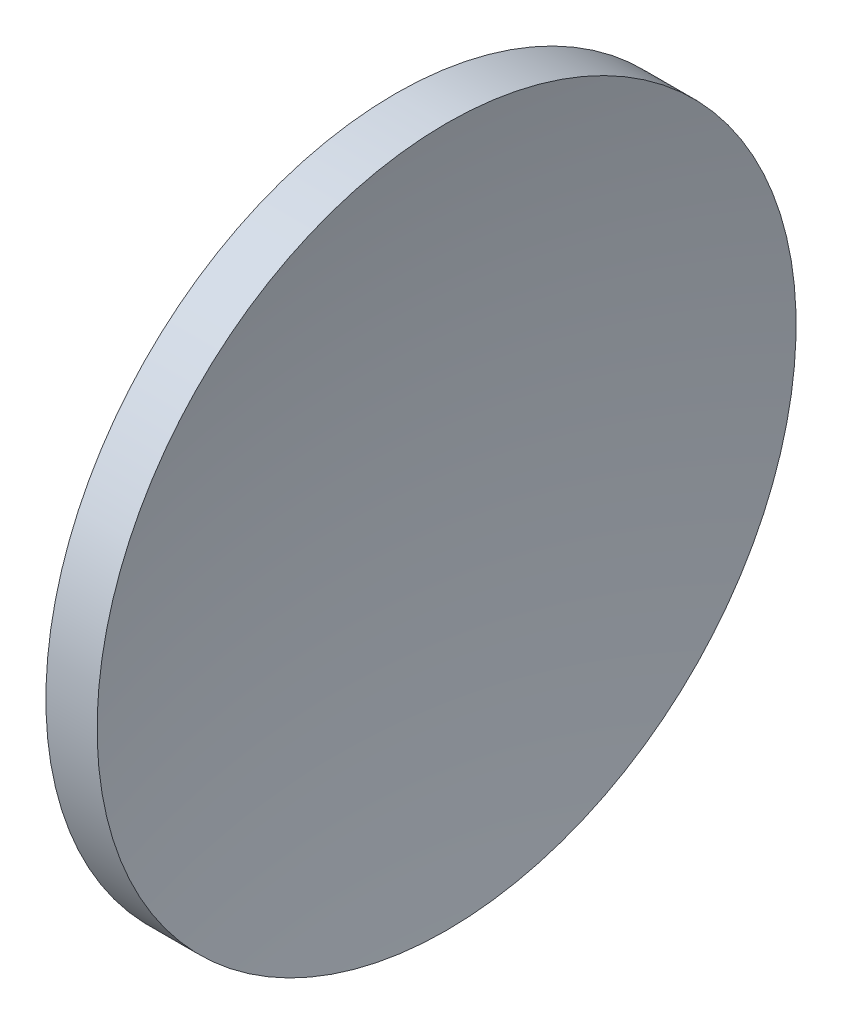
ISO-10303-21;
HEADER;
FILE_DESCRIPTION(('STEP AP214'),'2;1');
FILE_NAME('part.step','',(''),(''),'','','');
FILE_SCHEMA(('AUTOMOTIVE_DESIGN { 1 0 10303 214 1 1 1 1 }'));
ENDSEC;
DATA;
#1=APPLICATION_CONTEXT('core data for automotive mechanical design processes');
#2=APPLICATION_PROTOCOL_DEFINITION('international standard','automotive_design',2000,#1);
#3=PRODUCT_CONTEXT('',#1,'mechanical');
#4=PRODUCT('Part','Part','',(#3));
#5=PRODUCT_RELATED_PRODUCT_CATEGORY('part','',(#4));
#6=PRODUCT_DEFINITION_FORMATION('','',#4);
#7=PRODUCT_DEFINITION_CONTEXT('part definition',#1,'design');
#8=PRODUCT_DEFINITION('design','',#6,#7);
#9=PRODUCT_DEFINITION_SHAPE('','',#8);
#10=(LENGTH_UNIT() NAMED_UNIT(*) SI_UNIT(.MILLI.,.METRE.));
#11=(NAMED_UNIT(*) PLANE_ANGLE_UNIT() SI_UNIT($,.RADIAN.));
#12=(NAMED_UNIT(*) SI_UNIT($,.STERADIAN.) SOLID_ANGLE_UNIT());
#13=UNCERTAINTY_MEASURE_WITH_UNIT(LENGTH_MEASURE(1.E-05),#10,'distance_accuracy_value','');
#14=(GEOMETRIC_REPRESENTATION_CONTEXT(3) GLOBAL_UNCERTAINTY_ASSIGNED_CONTEXT((#13)) GLOBAL_UNIT_ASSIGNED_CONTEXT((#10,
#11,#12)) REPRESENTATION_CONTEXT('',''));
#15=CARTESIAN_POINT('',(0.,0.,0.));
#16=DIRECTION('',(0.,0.,1.));
#17=DIRECTION('',(1.,0.,0.));
#18=AXIS2_PLACEMENT_3D('',#15,#16,#17);
#19=CARTESIAN_POINT('',(327.098995671749,130.433680941881,0.));
#20=DIRECTION('',(-1.,0.,0.));
#21=DIRECTION('',(0.,1.,0.));
#22=AXIS2_PLACEMENT_3D('',#19,#20,#21);
#23=SPHERICAL_SURFACE('',#22,81.9);
#24=CARTESIAN_POINT('',(249.107906437145,130.433680941881,0.));
#25=DIRECTION('',(-1.,0.,0.));
#26=DIRECTION('',(0.,-1.,0.));
#27=AXIS2_PLACEMENT_3D('',#24,#25,#26);
#28=CIRCLE('',#27,24.9999999999999);
#29=CARTESIAN_POINT('',(249.107906437145,105.433680941881,0.));
#30=VERTEX_POINT('',#29);
#31=EDGE_CURVE('E41',#30,#30,#28,.T.);
#32=ORIENTED_EDGE('',*,*,#31,.T.);
#33=EDGE_LOOP('',(#32));
#34=FACE_BOUND('',#33,.T.);
#35=ADVANCED_FACE('F35',(#34),#23,.T.);
#36=CARTESIAN_POINT('',(372.998995671749,130.433680941881,0.));
#37=DIRECTION('',(-1.,0.,0.));
#38=DIRECTION('',(0.,1.,0.));
#39=AXIS2_PLACEMENT_3D('',#36,#37,#38);
#40=SPHERICAL_SURFACE('',#39,122.8);
#41=CARTESIAN_POINT('',(252.770712809521,130.433680941881,0.));
#42=DIRECTION('',(-1.,0.,0.));
#43=DIRECTION('',(0.,-1.,0.));
#44=AXIS2_PLACEMENT_3D('',#41,#42,#43);
#45=CIRCLE('',#44,24.9999999999999);
#46=CARTESIAN_POINT('',(252.770712809521,105.433680941881,0.));
#47=VERTEX_POINT('',#46);
#48=EDGE_CURVE('E10',#47,#47,#45,.T.);
#49=ORIENTED_EDGE('',*,*,#48,.F.);
#50=EDGE_LOOP('',(#49));
#51=FACE_BOUND('',#50,.T.);
#52=ADVANCED_FACE('F50',(#51),#40,.F.);
#53=CARTESIAN_POINT('',(231.888982595926,130.433680941881,0.));
#54=DIRECTION('',(-1.,0.,0.));
#55=DIRECTION('',(0.,-1.,0.));
#56=AXIS2_PLACEMENT_3D('',#53,#54,#55);
#57=CYLINDRICAL_SURFACE('',#56,24.9999999999999);
#58=ORIENTED_EDGE('',*,*,#31,.F.);
#59=EDGE_LOOP('',(#58));
#60=FACE_BOUND('',#59,.T.);
#61=ORIENTED_EDGE('',*,*,#48,.T.);
#62=EDGE_LOOP('',(#61));
#63=FACE_BOUND('',#62,.T.);
#64=ADVANCED_FACE('F48',(#60,#63),#57,.T.);
#65=CLOSED_SHELL('',(#35,#52,#64));
#66=MANIFOLD_SOLID_BREP('B2',#65);
#67=ADVANCED_BREP_SHAPE_REPRESENTATION('',(#18,#66),#14);
#68=SHAPE_DEFINITION_REPRESENTATION(#9,#67);
ENDSEC;
END-ISO-10303-21;
